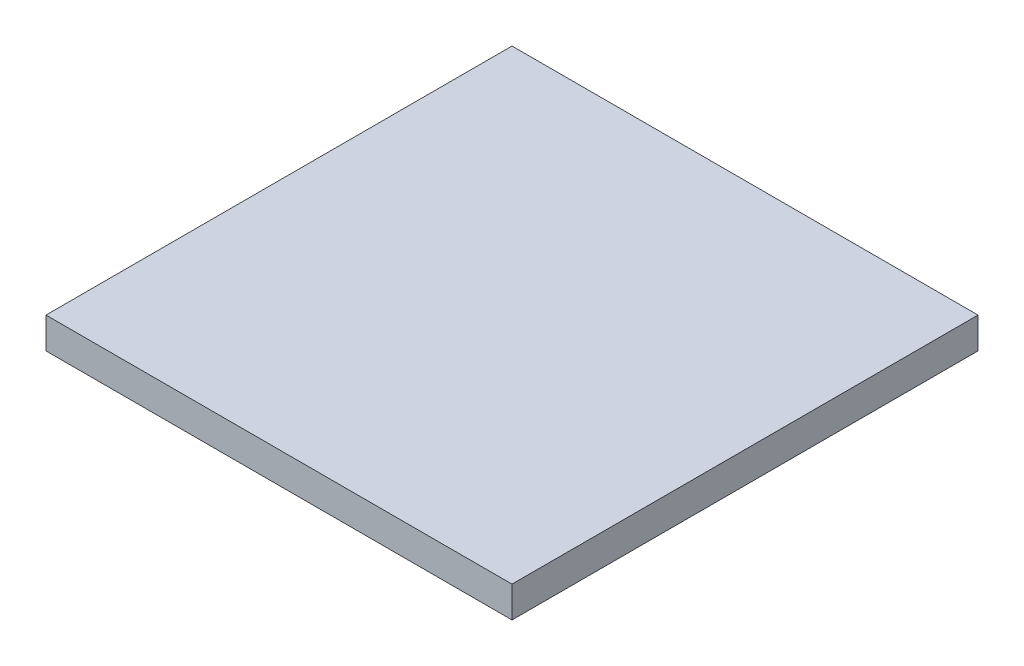
ISO-10303-21;
HEADER;
FILE_DESCRIPTION(('STEP AP214'),'2;1');
FILE_NAME('part.step','',(''),(''),'','','');
FILE_SCHEMA(('AUTOMOTIVE_DESIGN { 1 0 10303 214 1 1 1 1 }'));
ENDSEC;
DATA;
#1=APPLICATION_CONTEXT('core data for automotive mechanical design processes');
#2=APPLICATION_PROTOCOL_DEFINITION('international standard','automotive_design',2000,#1);
#3=PRODUCT_CONTEXT('',#1,'mechanical');
#4=PRODUCT('Part','Part','',(#3));
#5=PRODUCT_RELATED_PRODUCT_CATEGORY('part','',(#4));
#6=PRODUCT_DEFINITION_FORMATION('','',#4);
#7=PRODUCT_DEFINITION_CONTEXT('part definition',#1,'design');
#8=PRODUCT_DEFINITION('design','',#6,#7);
#9=PRODUCT_DEFINITION_SHAPE('','',#8);
#10=(LENGTH_UNIT() NAMED_UNIT(*) SI_UNIT(.MILLI.,.METRE.));
#11=(NAMED_UNIT(*) PLANE_ANGLE_UNIT() SI_UNIT($,.RADIAN.));
#12=(NAMED_UNIT(*) SI_UNIT($,.STERADIAN.) SOLID_ANGLE_UNIT());
#13=UNCERTAINTY_MEASURE_WITH_UNIT(LENGTH_MEASURE(1.E-05),#10,'distance_accuracy_value','');
#14=(GEOMETRIC_REPRESENTATION_CONTEXT(3) GLOBAL_UNCERTAINTY_ASSIGNED_CONTEXT((#13)) GLOBAL_UNIT_ASSIGNED_CONTEXT((#10,
#11,#12)) REPRESENTATION_CONTEXT('',''));
#15=CARTESIAN_POINT('',(0.,0.,0.));
#16=DIRECTION('',(0.,0.,1.));
#17=DIRECTION('',(1.,0.,0.));
#18=AXIS2_PLACEMENT_3D('',#15,#16,#17);
#19=CARTESIAN_POINT('',(0.,0.,381.));
#20=DIRECTION('',(1.,0.,0.));
#21=DIRECTION('',(0.,0.,-1.));
#22=AXIS2_PLACEMENT_3D('',#19,#20,#21);
#23=PLANE('',#22);
#24=DIRECTION('',(0.,-1.,0.));
#25=VECTOR('',#24,1.);
#26=CARTESIAN_POINT('',(0.,0.,0.));
#27=LINE('',#26,#25);
#28=CARTESIAN_POINT('',(0.,25.4,0.));
#29=VERTEX_POINT('',#28);
#30=CARTESIAN_POINT('',(0.,0.,0.));
#31=VERTEX_POINT('',#30);
#32=EDGE_CURVE('E107',#29,#31,#27,.T.);
#33=ORIENTED_EDGE('',*,*,#32,.T.);
#34=DIRECTION('',(0.,0.,-1.));
#35=VECTOR('',#34,1.);
#36=CARTESIAN_POINT('',(0.,0.,381.));
#37=LINE('',#36,#35);
#38=CARTESIAN_POINT('',(0.,0.,381.));
#39=VERTEX_POINT('',#38);
#40=EDGE_CURVE('E11',#39,#31,#37,.T.);
#41=ORIENTED_EDGE('',*,*,#40,.F.);
#42=DIRECTION('',(0.,-1.,0.));
#43=VECTOR('',#42,1.);
#44=CARTESIAN_POINT('',(0.,0.,381.));
#45=LINE('',#44,#43);
#46=CARTESIAN_POINT('',(0.,25.4,381.));
#47=VERTEX_POINT('',#46);
#48=EDGE_CURVE('E91',#47,#39,#45,.T.);
#49=ORIENTED_EDGE('',*,*,#48,.F.);
#50=DIRECTION('',(0.,0.,-1.));
#51=VECTOR('',#50,1.);
#52=CARTESIAN_POINT('',(0.,25.4,381.));
#53=LINE('',#52,#51);
#54=EDGE_CURVE('E103',#47,#29,#53,.T.);
#55=ORIENTED_EDGE('',*,*,#54,.T.);
#56=EDGE_LOOP('',(#33,#41,#49,#55));
#57=FACE_BOUND('',#56,.T.);
#58=ADVANCED_FACE('F39',(#57),#23,.F.);
#59=CARTESIAN_POINT('',(0.,0.,381.));
#60=DIRECTION('',(0.,1.,0.));
#61=DIRECTION('',(0.,0.,1.));
#62=AXIS2_PLACEMENT_3D('',#59,#60,#61);
#63=PLANE('',#62);
#64=DIRECTION('',(1.,0.,0.));
#65=VECTOR('',#64,1.);
#66=CARTESIAN_POINT('',(0.,0.,0.));
#67=LINE('',#66,#65);
#68=CARTESIAN_POINT('',(381.,0.,0.));
#69=VERTEX_POINT('',#68);
#70=EDGE_CURVE('E96',#31,#69,#67,.T.);
#71=ORIENTED_EDGE('',*,*,#70,.T.);
#72=DIRECTION('',(0.,0.,-1.));
#73=VECTOR('',#72,1.);
#74=CARTESIAN_POINT('',(381.,0.,381.));
#75=LINE('',#74,#73);
#76=CARTESIAN_POINT('',(381.,0.,381.));
#77=VERTEX_POINT('',#76);
#78=EDGE_CURVE('E48',#77,#69,#75,.T.);
#79=ORIENTED_EDGE('',*,*,#78,.F.);
#80=DIRECTION('',(1.,0.,0.));
#81=VECTOR('',#80,1.);
#82=CARTESIAN_POINT('',(0.,0.,381.));
#83=LINE('',#82,#81);
#84=EDGE_CURVE('E86',#39,#77,#83,.T.);
#85=ORIENTED_EDGE('',*,*,#84,.F.);
#86=ORIENTED_EDGE('',*,*,#40,.T.);
#87=EDGE_LOOP('',(#71,#79,#85,#86));
#88=FACE_BOUND('',#87,.T.);
#89=ADVANCED_FACE('F95',(#88),#63,.F.);
#90=CARTESIAN_POINT('',(381.,0.,381.));
#91=DIRECTION('',(-1.,0.,0.));
#92=DIRECTION('',(0.,0.,1.));
#93=AXIS2_PLACEMENT_3D('',#90,#91,#92);
#94=PLANE('',#93);
#95=DIRECTION('',(0.,1.,0.));
#96=VECTOR('',#95,1.);
#97=CARTESIAN_POINT('',(381.,0.,0.));
#98=LINE('',#97,#96);
#99=CARTESIAN_POINT('',(381.,25.4,0.));
#100=VERTEX_POINT('',#99);
#101=EDGE_CURVE('E73',#69,#100,#98,.T.);
#102=ORIENTED_EDGE('',*,*,#101,.T.);
#103=DIRECTION('',(0.,0.,-1.));
#104=VECTOR('',#103,1.);
#105=CARTESIAN_POINT('',(381.,25.4,381.));
#106=LINE('',#105,#104);
#107=CARTESIAN_POINT('',(381.,25.4,381.));
#108=VERTEX_POINT('',#107);
#109=EDGE_CURVE('E98',#108,#100,#106,.T.);
#110=ORIENTED_EDGE('',*,*,#109,.F.);
#111=DIRECTION('',(0.,1.,0.));
#112=VECTOR('',#111,1.);
#113=CARTESIAN_POINT('',(381.,0.,381.));
#114=LINE('',#113,#112);
#115=EDGE_CURVE('E89',#77,#108,#114,.T.);
#116=ORIENTED_EDGE('',*,*,#115,.F.);
#117=ORIENTED_EDGE('',*,*,#78,.T.);
#118=EDGE_LOOP('',(#102,#110,#116,#117));
#119=FACE_BOUND('',#118,.T.);
#120=ADVANCED_FACE('F99',(#119),#94,.F.);
#121=CARTESIAN_POINT('',(0.,25.4,381.));
#122=DIRECTION('',(0.,-1.,0.));
#123=DIRECTION('',(0.,0.,-1.));
#124=AXIS2_PLACEMENT_3D('',#121,#122,#123);
#125=PLANE('',#124);
#126=DIRECTION('',(-1.,0.,0.));
#127=VECTOR('',#126,1.);
#128=CARTESIAN_POINT('',(0.,25.4,0.));
#129=LINE('',#128,#127);
#130=EDGE_CURVE('E79',#100,#29,#129,.T.);
#131=ORIENTED_EDGE('',*,*,#130,.T.);
#132=ORIENTED_EDGE('',*,*,#54,.F.);
#133=DIRECTION('',(-1.,0.,0.));
#134=VECTOR('',#133,1.);
#135=CARTESIAN_POINT('',(0.,25.4,381.));
#136=LINE('',#135,#134);
#137=EDGE_CURVE('E56',#108,#47,#136,.T.);
#138=ORIENTED_EDGE('',*,*,#137,.F.);
#139=ORIENTED_EDGE('',*,*,#109,.T.);
#140=EDGE_LOOP('',(#131,#132,#138,#139));
#141=FACE_BOUND('',#140,.T.);
#142=ADVANCED_FACE('F120',(#141),#125,.F.);
#143=CARTESIAN_POINT('',(0.,0.,381.));
#144=DIRECTION('',(0.,0.,-1.));
#145=DIRECTION('',(-1.,0.,0.));
#146=AXIS2_PLACEMENT_3D('',#143,#144,#145);
#147=PLANE('',#146);
#148=ORIENTED_EDGE('',*,*,#48,.T.);
#149=ORIENTED_EDGE('',*,*,#84,.T.);
#150=ORIENTED_EDGE('',*,*,#115,.T.);
#151=ORIENTED_EDGE('',*,*,#137,.T.);
#152=EDGE_LOOP('',(#148,#149,#150,#151));
#153=FACE_BOUND('',#152,.T.);
#154=ADVANCED_FACE('F87',(#153),#147,.F.);
#155=CARTESIAN_POINT('',(0.,0.,0.));
#156=DIRECTION('',(0.,0.,-1.));
#157=DIRECTION('',(-1.,0.,0.));
#158=AXIS2_PLACEMENT_3D('',#155,#156,#157);
#159=PLANE('',#158);
#160=ORIENTED_EDGE('',*,*,#32,.F.);
#161=ORIENTED_EDGE('',*,*,#130,.F.);
#162=ORIENTED_EDGE('',*,*,#101,.F.);
#163=ORIENTED_EDGE('',*,*,#70,.F.);
#164=EDGE_LOOP('',(#160,#161,#162,#163));
#165=FACE_BOUND('',#164,.T.);
#166=ADVANCED_FACE('F123',(#165),#159,.T.);
#167=CLOSED_SHELL('',(#58,#89,#120,#142,#154,#166));
#168=MANIFOLD_SOLID_BREP('B2',#167);
#169=ADVANCED_BREP_SHAPE_REPRESENTATION('',(#18,#168),#14);
#170=SHAPE_DEFINITION_REPRESENTATION(#9,#169);
ENDSEC;
END-ISO-10303-21;
